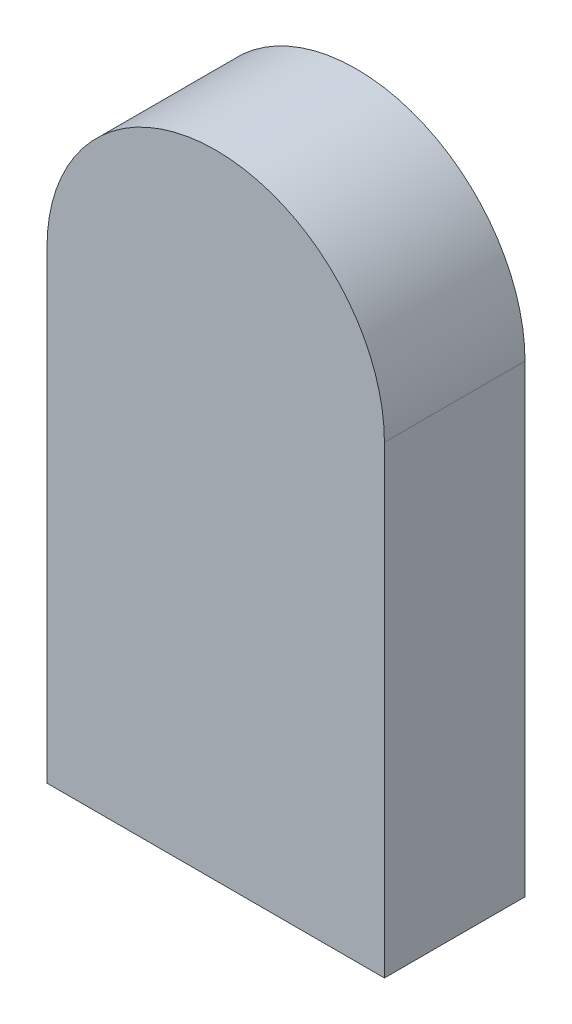
ISO-10303-21;
HEADER;
FILE_DESCRIPTION(('STEP AP214'),'2;1');
FILE_NAME('part.step','',(''),(''),'','','');
FILE_SCHEMA(('AUTOMOTIVE_DESIGN { 1 0 10303 214 1 1 1 1 }'));
ENDSEC;
DATA;
#1=APPLICATION_CONTEXT('core data for automotive mechanical design processes');
#2=APPLICATION_PROTOCOL_DEFINITION('international standard','automotive_design',2000,#1);
#3=PRODUCT_CONTEXT('',#1,'mechanical');
#4=PRODUCT('Part','Part','',(#3));
#5=PRODUCT_RELATED_PRODUCT_CATEGORY('part','',(#4));
#6=PRODUCT_DEFINITION_FORMATION('','',#4);
#7=PRODUCT_DEFINITION_CONTEXT('part definition',#1,'design');
#8=PRODUCT_DEFINITION('design','',#6,#7);
#9=PRODUCT_DEFINITION_SHAPE('','',#8);
#10=(LENGTH_UNIT() NAMED_UNIT(*) SI_UNIT(.MILLI.,.METRE.));
#11=(NAMED_UNIT(*) PLANE_ANGLE_UNIT() SI_UNIT($,.RADIAN.));
#12=(NAMED_UNIT(*) SI_UNIT($,.STERADIAN.) SOLID_ANGLE_UNIT());
#13=UNCERTAINTY_MEASURE_WITH_UNIT(LENGTH_MEASURE(1.E-05),#10,'distance_accuracy_value','');
#14=(GEOMETRIC_REPRESENTATION_CONTEXT(3) GLOBAL_UNCERTAINTY_ASSIGNED_CONTEXT((#13)) GLOBAL_UNIT_ASSIGNED_CONTEXT((#10,
#11,#12)) REPRESENTATION_CONTEXT('',''));
#15=CARTESIAN_POINT('',(0.,0.,0.));
#16=DIRECTION('',(0.,0.,1.));
#17=DIRECTION('',(1.,0.,0.));
#18=AXIS2_PLACEMENT_3D('',#15,#16,#17);
#19=CARTESIAN_POINT('',(-2.87,-4.05,0.));
#20=DIRECTION('',(0.,1.,0.));
#21=DIRECTION('',(1.,0.,0.));
#22=AXIS2_PLACEMENT_3D('',#19,#20,#21);
#23=PLANE('',#22);
#24=DIRECTION('',(1.,0.,0.));
#25=VECTOR('',#24,1.);
#26=CARTESIAN_POINT('',(-2.87,-4.05,0.));
#27=LINE('',#26,#25);
#28=CARTESIAN_POINT('',(-2.87,-4.05,0.));
#29=VERTEX_POINT('',#28);
#30=CARTESIAN_POINT('',(-2.63,-4.05,0.));
#31=VERTEX_POINT('',#30);
#32=EDGE_CURVE('E11',#29,#31,#27,.T.);
#33=ORIENTED_EDGE('',*,*,#32,.T.);
#34=DIRECTION('',(0.,0.,1.));
#35=VECTOR('',#34,1.);
#36=CARTESIAN_POINT('',(-2.63,-4.05,0.));
#37=LINE('',#36,#35);
#38=CARTESIAN_POINT('',(-2.63,-4.05,0.1));
#39=VERTEX_POINT('',#38);
#40=EDGE_CURVE('E24',#31,#39,#37,.T.);
#41=ORIENTED_EDGE('',*,*,#40,.T.);
#42=DIRECTION('',(1.,0.,0.));
#43=VECTOR('',#42,1.);
#44=CARTESIAN_POINT('',(-2.87,-4.05,0.1));
#45=LINE('',#44,#43);
#46=CARTESIAN_POINT('',(-2.87,-4.05,0.1));
#47=VERTEX_POINT('',#46);
#48=EDGE_CURVE('E87',#47,#39,#45,.T.);
#49=ORIENTED_EDGE('',*,*,#48,.F.);
#50=DIRECTION('',(0.,0.,1.));
#51=VECTOR('',#50,1.);
#52=CARTESIAN_POINT('',(-2.87,-4.05,0.));
#53=LINE('',#52,#51);
#54=EDGE_CURVE('E36',#29,#47,#53,.T.);
#55=ORIENTED_EDGE('',*,*,#54,.F.);
#56=EDGE_LOOP('',(#33,#41,#49,#55));
#57=FACE_BOUND('',#56,.T.);
#58=ADVANCED_FACE('F17',(#57),#23,.F.);
#59=CARTESIAN_POINT('',(-2.63,-4.05,0.));
#60=DIRECTION('',(-1.,0.,0.));
#61=DIRECTION('',(0.,1.,0.));
#62=AXIS2_PLACEMENT_3D('',#59,#60,#61);
#63=PLANE('',#62);
#64=DIRECTION('',(0.,1.,0.));
#65=VECTOR('',#64,1.);
#66=CARTESIAN_POINT('',(-2.63,-4.05,0.));
#67=LINE('',#66,#65);
#68=CARTESIAN_POINT('',(-2.63,-3.72,0.));
#69=VERTEX_POINT('',#68);
#70=EDGE_CURVE('E84',#31,#69,#67,.T.);
#71=ORIENTED_EDGE('',*,*,#70,.T.);
#72=DIRECTION('',(0.,0.,1.));
#73=VECTOR('',#72,1.);
#74=CARTESIAN_POINT('',(-2.63,-3.72,0.));
#75=LINE('',#74,#73);
#76=CARTESIAN_POINT('',(-2.63,-3.72,0.1));
#77=VERTEX_POINT('',#76);
#78=EDGE_CURVE('E82',#69,#77,#75,.T.);
#79=ORIENTED_EDGE('',*,*,#78,.T.);
#80=DIRECTION('',(0.,1.,0.));
#81=VECTOR('',#80,1.);
#82=CARTESIAN_POINT('',(-2.63,-4.05,0.1));
#83=LINE('',#82,#81);
#84=EDGE_CURVE('E72',#39,#77,#83,.T.);
#85=ORIENTED_EDGE('',*,*,#84,.F.);
#86=ORIENTED_EDGE('',*,*,#40,.F.);
#87=EDGE_LOOP('',(#71,#79,#85,#86));
#88=FACE_BOUND('',#87,.T.);
#89=ADVANCED_FACE('F89',(#88),#63,.F.);
#90=CARTESIAN_POINT('',(-2.75,-3.72,0.));
#91=DIRECTION('',(0.,0.,-1.));
#92=DIRECTION('',(1.,0.,0.));
#93=AXIS2_PLACEMENT_3D('',#90,#91,#92);
#94=CYLINDRICAL_SURFACE('',#93,0.12);
#95=CARTESIAN_POINT('',(-2.75,-3.72,0.));
#96=DIRECTION('',(0.,0.,1.));
#97=DIRECTION('',(1.,0.,0.));
#98=AXIS2_PLACEMENT_3D('',#95,#96,#97);
#99=CIRCLE('',#98,0.12);
#100=CARTESIAN_POINT('',(-2.87,-3.72,0.));
#101=VERTEX_POINT('',#100);
#102=EDGE_CURVE('E62',#69,#101,#99,.T.);
#103=ORIENTED_EDGE('',*,*,#102,.T.);
#104=DIRECTION('',(0.,0.,1.));
#105=VECTOR('',#104,1.);
#106=CARTESIAN_POINT('',(-2.87,-3.72,0.));
#107=LINE('',#106,#105);
#108=CARTESIAN_POINT('',(-2.87,-3.72,0.1));
#109=VERTEX_POINT('',#108);
#110=EDGE_CURVE('E57',#101,#109,#107,.T.);
#111=ORIENTED_EDGE('',*,*,#110,.T.);
#112=CARTESIAN_POINT('',(-2.75,-3.72,0.1));
#113=DIRECTION('',(0.,0.,1.));
#114=DIRECTION('',(1.,0.,0.));
#115=AXIS2_PLACEMENT_3D('',#112,#113,#114);
#116=CIRCLE('',#115,0.12);
#117=EDGE_CURVE('E60',#77,#109,#116,.T.);
#118=ORIENTED_EDGE('',*,*,#117,.F.);
#119=ORIENTED_EDGE('',*,*,#78,.F.);
#120=EDGE_LOOP('',(#103,#111,#118,#119));
#121=FACE_BOUND('',#120,.T.);
#122=ADVANCED_FACE('F59',(#121),#94,.T.);
#123=CARTESIAN_POINT('',(-2.87,-4.05,0.));
#124=DIRECTION('',(-1.,0.,0.));
#125=DIRECTION('',(0.,1.,0.));
#126=AXIS2_PLACEMENT_3D('',#123,#124,#125);
#127=PLANE('',#126);
#128=ORIENTED_EDGE('',*,*,#54,.T.);
#129=DIRECTION('',(0.,1.,0.));
#130=VECTOR('',#129,1.);
#131=CARTESIAN_POINT('',(-2.87,-4.05,0.1));
#132=LINE('',#131,#130);
#133=EDGE_CURVE('E71',#47,#109,#132,.T.);
#134=ORIENTED_EDGE('',*,*,#133,.T.);
#135=ORIENTED_EDGE('',*,*,#110,.F.);
#136=DIRECTION('',(0.,1.,0.));
#137=VECTOR('',#136,1.);
#138=CARTESIAN_POINT('',(-2.87,-4.05,0.));
#139=LINE('',#138,#137);
#140=EDGE_CURVE('E76',#29,#101,#139,.T.);
#141=ORIENTED_EDGE('',*,*,#140,.F.);
#142=EDGE_LOOP('',(#128,#134,#135,#141));
#143=FACE_BOUND('',#142,.T.);
#144=ADVANCED_FACE('F75',(#143),#127,.T.);
#145=CARTESIAN_POINT('',(-2.75,-3.849490847913,0.));
#146=DIRECTION('',(0.,0.,1.));
#147=DIRECTION('',(1.,0.,0.));
#148=AXIS2_PLACEMENT_3D('',#145,#146,#147);
#149=PLANE('',#148);
#150=ORIENTED_EDGE('',*,*,#140,.T.);
#151=ORIENTED_EDGE('',*,*,#102,.F.);
#152=ORIENTED_EDGE('',*,*,#70,.F.);
#153=ORIENTED_EDGE('',*,*,#32,.F.);
#154=EDGE_LOOP('',(#150,#151,#152,#153));
#155=FACE_BOUND('',#154,.T.);
#156=ADVANCED_FACE('F91',(#155),#149,.F.);
#157=CARTESIAN_POINT('',(-2.75,-3.849490847913,0.1));
#158=DIRECTION('',(0.,0.,1.));
#159=DIRECTION('',(1.,0.,0.));
#160=AXIS2_PLACEMENT_3D('',#157,#158,#159);
#161=PLANE('',#160);
#162=ORIENTED_EDGE('',*,*,#48,.T.);
#163=ORIENTED_EDGE('',*,*,#84,.T.);
#164=ORIENTED_EDGE('',*,*,#117,.T.);
#165=ORIENTED_EDGE('',*,*,#133,.F.);
#166=EDGE_LOOP('',(#162,#163,#164,#165));
#167=FACE_BOUND('',#166,.T.);
#168=ADVANCED_FACE('F70',(#167),#161,.T.);
#169=CLOSED_SHELL('',(#58,#89,#122,#144,#156,#168));
#170=MANIFOLD_SOLID_BREP('B1',#169);
#171=ADVANCED_BREP_SHAPE_REPRESENTATION('',(#18,#170),#14);
#172=SHAPE_DEFINITION_REPRESENTATION(#9,#171);
ENDSEC;
END-ISO-10303-21;
